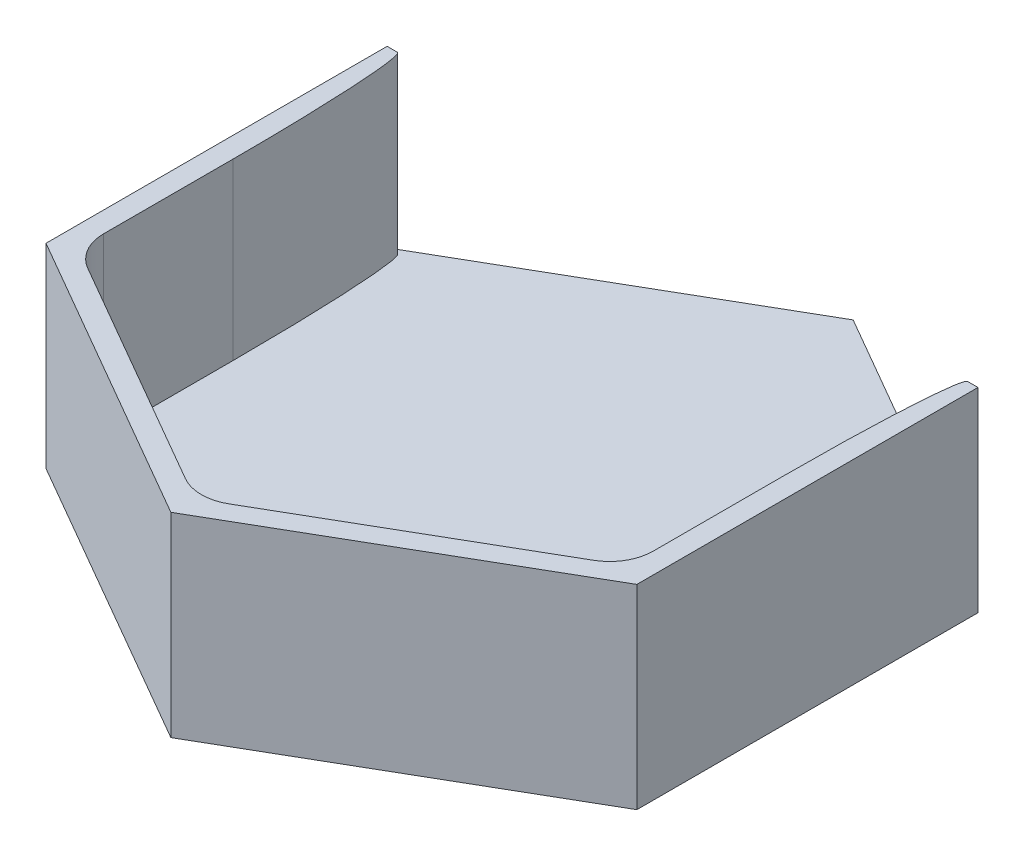
ISO-10303-21;
HEADER;
FILE_DESCRIPTION(('STEP AP214'),'2;1');
FILE_NAME('part.step','',(''),(''),'','','');
FILE_SCHEMA(('AUTOMOTIVE_DESIGN { 1 0 10303 214 1 1 1 1 }'));
ENDSEC;
DATA;
#1=APPLICATION_CONTEXT('core data for automotive mechanical design processes');
#2=APPLICATION_PROTOCOL_DEFINITION('international standard','automotive_design',2000,#1);
#3=PRODUCT_CONTEXT('',#1,'mechanical');
#4=PRODUCT('Part','Part','',(#3));
#5=PRODUCT_RELATED_PRODUCT_CATEGORY('part','',(#4));
#6=PRODUCT_DEFINITION_FORMATION('','',#4);
#7=PRODUCT_DEFINITION_CONTEXT('part definition',#1,'design');
#8=PRODUCT_DEFINITION('design','',#6,#7);
#9=PRODUCT_DEFINITION_SHAPE('','',#8);
#10=(LENGTH_UNIT() NAMED_UNIT(*) SI_UNIT(.MILLI.,.METRE.));
#11=(NAMED_UNIT(*) PLANE_ANGLE_UNIT() SI_UNIT($,.RADIAN.));
#12=(NAMED_UNIT(*) SI_UNIT($,.STERADIAN.) SOLID_ANGLE_UNIT());
#13=UNCERTAINTY_MEASURE_WITH_UNIT(LENGTH_MEASURE(1.E-05),#10,'distance_accuracy_value','');
#14=(GEOMETRIC_REPRESENTATION_CONTEXT(3) GLOBAL_UNCERTAINTY_ASSIGNED_CONTEXT((#13)) GLOBAL_UNIT_ASSIGNED_CONTEXT((#10,
#11,#12)) REPRESENTATION_CONTEXT('',''));
#15=CARTESIAN_POINT('',(0.,0.,0.));
#16=DIRECTION('',(0.,0.,1.));
#17=DIRECTION('',(1.,0.,0.));
#18=AXIS2_PLACEMENT_3D('',#15,#16,#17);
#19=CARTESIAN_POINT('',(-2.48065457064683E-13,25.4,-49.6521231503077));
#20=DIRECTION('',(0.499999999999999,0.,0.866025403784439));
#21=DIRECTION('',(0.866025403784439,0.,-0.499999999999999));
#22=AXIS2_PLACEMENT_3D('',#19,#20,#21);
#23=PLANE('',#22);
#24=DIRECTION('',(0.,-1.,0.));
#25=VECTOR('',#24,1.);
#26=CARTESIAN_POINT('',(-43.,25.4,-24.826061575154));
#27=LINE('',#26,#25);
#28=CARTESIAN_POINT('',(-43.,0.,-24.826061575154));
#29=VERTEX_POINT('',#28);
#30=CARTESIAN_POINT('',(-42.9999999999999,-3.,-24.8260615751542));
#31=VERTEX_POINT('',#30);
#32=EDGE_CURVE('E344',#29,#31,#27,.T.);
#33=ORIENTED_EDGE('',*,*,#32,.F.);
#34=DIRECTION('',(0.866025403784439,0.,-0.499999999999999));
#35=VECTOR('',#34,1.);
#36=CARTESIAN_POINT('',(-41.5,0.,-25.6920869789385));
#37=LINE('',#36,#35);
#38=CARTESIAN_POINT('',(4.02455846426619E-13,0.,-49.6521231503081));
#39=VERTEX_POINT('',#38);
#40=EDGE_CURVE('E227',#29,#39,#37,.T.);
#41=ORIENTED_EDGE('',*,*,#40,.T.);
#42=DIRECTION('',(0.,-1.,0.));
#43=VECTOR('',#42,1.);
#44=CARTESIAN_POINT('',(-2.48065457064683E-13,25.4,-49.6521231503077));
#45=LINE('',#44,#43);
#46=CARTESIAN_POINT('',(4.05925293378573E-13,-3.,-49.6521231503078));
#47=VERTEX_POINT('',#46);
#48=EDGE_CURVE('E224',#39,#47,#45,.T.);
#49=ORIENTED_EDGE('',*,*,#48,.T.);
#50=DIRECTION('',(0.866025403784442,0.,-0.499999999999994));
#51=VECTOR('',#50,1.);
#52=CARTESIAN_POINT('',(-42.9999999999999,-3.,-24.8260615751542));
#53=LINE('',#52,#51);
#54=EDGE_CURVE('E362',#31,#47,#53,.T.);
#55=ORIENTED_EDGE('',*,*,#54,.F.);
#56=EDGE_LOOP('',(#33,#41,#49,#55));
#57=FACE_BOUND('',#56,.T.);
#58=ADVANCED_FACE('F81',(#57),#23,.F.);
#59=CARTESIAN_POINT('',(0.,25.4,0.));
#60=DIRECTION('',(0.,1.,0.));
#61=DIRECTION('',(0.,0.,1.));
#62=AXIS2_PLACEMENT_3D('',#59,#60,#61);
#63=PLANE('',#62);
#64=DIRECTION('',(1.,0.,0.));
#65=VECTOR('',#64,1.);
#66=CARTESIAN_POINT('',(-43.,25.4,-24.826061575154));
#67=LINE('',#66,#65);
#68=CARTESIAN_POINT('',(41.5,25.4,-24.826061575154));
#69=VERTEX_POINT('',#68);
#70=CARTESIAN_POINT('',(43.,25.4,-24.826061575154));
#71=VERTEX_POINT('',#70);
#72=EDGE_CURVE('E233',#69,#71,#67,.T.);
#73=ORIENTED_EDGE('',*,*,#72,.F.);
#74=CARTESIAN_POINT('',(40.,25.4,0.573938424845981));
#75=CARTESIAN_POINT('',(40.0000000000002,25.4,-24.826061575154));
#76=CARTESIAN_POINT('',(41.5,25.4,-24.826061575154));
#77=(BOUNDED_CURVE() B_SPLINE_CURVE(2,(#74,#75,#76),.UNSPECIFIED.,.F.,
.F.) B_SPLINE_CURVE_WITH_KNOTS((3,3),(0.,1.),
.UNSPECIFIED.) CURVE() GEOMETRIC_REPRESENTATION_ITEM() RATIONAL_B_SPLINE_CURVE((1.,
0.707106781186549,1.)) REPRESENTATION_ITEM(''));
#78=CARTESIAN_POINT('',(40.,25.4,0.573938424845981));
#79=VERTEX_POINT('',#78);
#80=EDGE_CURVE('E386',#69,#79,#77,.F.);
#81=ORIENTED_EDGE('',*,*,#80,.T.);
#82=DIRECTION('',(0.,0.,-1.));
#83=VECTOR('',#82,1.);
#84=CARTESIAN_POINT('',(39.9999999999999,25.4,23.0940107675851));
#85=LINE('',#84,#83);
#86=CARTESIAN_POINT('',(39.9999999999999,25.4,19.427836558231));
#87=VERTEX_POINT('',#86);
#88=EDGE_CURVE('E285',#87,#79,#85,.T.);
#89=ORIENTED_EDGE('',*,*,#88,.F.);
#90=CARTESIAN_POINT('',(33.6499999999999,25.4,19.427836558231));
#91=DIRECTION('',(0.,1.,0.));
#92=DIRECTION('',(0.,0.,1.));
#93=AXIS2_PLACEMENT_3D('',#90,#91,#92);
#94=CIRCLE('',#93,6.35);
#95=CARTESIAN_POINT('',(36.825,25.4,24.9270978722622));
#96=VERTEX_POINT('',#95);
#97=EDGE_CURVE('E13',#87,#96,#94,.F.);
#98=ORIENTED_EDGE('',*,*,#97,.T.);
#99=DIRECTION('',(0.866025403784438,0.,-0.500000000000002));
#100=VECTOR('',#99,1.);
#101=CARTESIAN_POINT('',(0.,25.4,46.1880215351702));
#102=LINE('',#101,#100);
#103=CARTESIAN_POINT('',(3.17499999999998,25.4,44.3549344304931));
#104=VERTEX_POINT('',#103);
#105=EDGE_CURVE('E289',#104,#96,#102,.T.);
#106=ORIENTED_EDGE('',*,*,#105,.F.);
#107=CARTESIAN_POINT('',(0.,25.4,38.8556731164619));
#108=DIRECTION('',(0.,1.,0.));
#109=DIRECTION('',(0.,0.,1.));
#110=AXIS2_PLACEMENT_3D('',#107,#108,#109);
#111=CIRCLE('',#110,6.35);
#112=CARTESIAN_POINT('',(-3.17500000000005,25.4,44.3549344304931));
#113=VERTEX_POINT('',#112);
#114=EDGE_CURVE('E90',#104,#113,#111,.F.);
#115=ORIENTED_EDGE('',*,*,#114,.T.);
#116=DIRECTION('',(0.866025403784436,0.,0.500000000000005));
#117=VECTOR('',#116,1.);
#118=CARTESIAN_POINT('',(-40.,25.4,23.0940107675849));
#119=LINE('',#118,#117);
#120=CARTESIAN_POINT('',(-36.8250000000001,25.4,24.927097872262));
#121=VERTEX_POINT('',#120);
#122=EDGE_CURVE('E299',#121,#113,#119,.T.);
#123=ORIENTED_EDGE('',*,*,#122,.F.);
#124=CARTESIAN_POINT('',(-33.65,25.4,19.4278365582308));
#125=DIRECTION('',(0.,1.,0.));
#126=DIRECTION('',(0.,0.,1.));
#127=AXIS2_PLACEMENT_3D('',#124,#125,#126);
#128=CIRCLE('',#127,6.35);
#129=CARTESIAN_POINT('',(-40.,25.4,19.4278365582308));
#130=VERTEX_POINT('',#129);
#131=EDGE_CURVE('E292',#121,#130,#128,.F.);
#132=ORIENTED_EDGE('',*,*,#131,.T.);
#133=DIRECTION('',(0.,0.,1.));
#134=VECTOR('',#133,1.);
#135=CARTESIAN_POINT('',(-40.,25.4,-23.0940107675852));
#136=LINE('',#135,#134);
#137=CARTESIAN_POINT('',(-40.,25.4,0.573938424845988));
#138=VERTEX_POINT('',#137);
#139=EDGE_CURVE('E258',#138,#130,#136,.T.);
#140=ORIENTED_EDGE('',*,*,#139,.F.);
#141=CARTESIAN_POINT('',(-41.5,25.4,-24.826061575154));
#142=CARTESIAN_POINT('',(-40.,25.4,-24.826061575154));
#143=CARTESIAN_POINT('',(-40.,25.4,0.573938424845988));
#144=(BOUNDED_CURVE() B_SPLINE_CURVE(2,(#141,#142,#143),.UNSPECIFIED.,.F.,
.F.) B_SPLINE_CURVE_WITH_KNOTS((3,3),(0.,1.),
.UNSPECIFIED.) CURVE() GEOMETRIC_REPRESENTATION_ITEM() RATIONAL_B_SPLINE_CURVE((1.,
0.707106781186548,1.)) REPRESENTATION_ITEM(''));
#145=CARTESIAN_POINT('',(-41.5,25.4,-24.826061575154));
#146=VERTEX_POINT('',#145);
#147=EDGE_CURVE('E468',#138,#146,#144,.F.);
#148=ORIENTED_EDGE('',*,*,#147,.T.);
#149=CARTESIAN_POINT('',(-43.,25.4,-24.826061575154));
#150=VERTEX_POINT('',#149);
#151=EDGE_CURVE('E215',#150,#146,#67,.T.);
#152=ORIENTED_EDGE('',*,*,#151,.F.);
#153=DIRECTION('',(0.,0.,1.));
#154=VECTOR('',#153,1.);
#155=CARTESIAN_POINT('',(-43.,25.4,-24.826061575154));
#156=LINE('',#155,#154);
#157=CARTESIAN_POINT('',(-43.0000000000001,25.4,24.8260615751537));
#158=VERTEX_POINT('',#157);
#159=EDGE_CURVE('E327',#150,#158,#156,.T.);
#160=ORIENTED_EDGE('',*,*,#159,.T.);
#161=DIRECTION('',(0.866025403784438,0.,0.500000000000001));
#162=VECTOR('',#161,1.);
#163=CARTESIAN_POINT('',(-43.0000000000001,25.4,24.8260615751537));
#164=LINE('',#163,#162);
#165=CARTESIAN_POINT('',(0.,25.4,49.6521231503078));
#166=VERTEX_POINT('',#165);
#167=EDGE_CURVE('E330',#158,#166,#164,.T.);
#168=ORIENTED_EDGE('',*,*,#167,.T.);
#169=DIRECTION('',(0.866025403784438,0.,-0.500000000000001));
#170=VECTOR('',#169,1.);
#171=CARTESIAN_POINT('',(0.,25.4,49.6521231503078));
#172=LINE('',#171,#170);
#173=CARTESIAN_POINT('',(43.0000000000001,25.4,24.8260615751539));
#174=VERTEX_POINT('',#173);
#175=EDGE_CURVE('E333',#166,#174,#172,.T.);
#176=ORIENTED_EDGE('',*,*,#175,.T.);
#177=DIRECTION('',(0.,0.,-1.));
#178=VECTOR('',#177,1.);
#179=CARTESIAN_POINT('',(43.0000000000001,25.4,24.8260615751539));
#180=LINE('',#179,#178);
#181=EDGE_CURVE('E288',#174,#71,#180,.T.);
#182=ORIENTED_EDGE('',*,*,#181,.T.);
#183=EDGE_LOOP('',(#73,#81,#89,#98,#106,#115,#123,#132,#140,#148,#152,#160,#168,#176,#182));
#184=FACE_BOUND('',#183,.T.);
#185=ADVANCED_FACE('F298',(#184),#63,.T.);
#186=CARTESIAN_POINT('',(43.0000000000001,25.4,24.8260615751539));
#187=DIRECTION('',(-1.,0.,0.));
#188=DIRECTION('',(0.,0.,1.));
#189=AXIS2_PLACEMENT_3D('',#186,#187,#188);
#190=PLANE('',#189);
#191=DIRECTION('',(0.,-1.,0.));
#192=VECTOR('',#191,1.);
#193=CARTESIAN_POINT('',(43.0000000000001,25.4,24.8260615751539));
#194=LINE('',#193,#192);
#195=CARTESIAN_POINT('',(43.0000000000001,-3.,24.8260615751539));
#196=VERTEX_POINT('',#195);
#197=EDGE_CURVE('E336',#174,#196,#194,.T.);
#198=ORIENTED_EDGE('',*,*,#197,.T.);
#199=DIRECTION('',(0.,0.,1.));
#200=VECTOR('',#199,1.);
#201=CARTESIAN_POINT('',(43.0000000000003,-3.,-24.8260615751535));
#202=LINE('',#201,#200);
#203=CARTESIAN_POINT('',(43.0000000000003,-3.,-24.8260615751535));
#204=VERTEX_POINT('',#203);
#205=EDGE_CURVE('E226',#204,#196,#202,.T.);
#206=ORIENTED_EDGE('',*,*,#205,.F.);
#207=DIRECTION('',(0.,-1.,0.));
#208=VECTOR('',#207,1.);
#209=CARTESIAN_POINT('',(43.,25.4,-24.8260615751537));
#210=LINE('',#209,#208);
#211=CARTESIAN_POINT('',(43.,0.,-24.826061575154));
#212=VERTEX_POINT('',#211);
#213=EDGE_CURVE('E222',#212,#204,#210,.T.);
#214=ORIENTED_EDGE('',*,*,#213,.F.);
#215=EDGE_CURVE('E230',#71,#212,#210,.T.);
#216=ORIENTED_EDGE('',*,*,#215,.F.);
#217=ORIENTED_EDGE('',*,*,#181,.F.);
#218=EDGE_LOOP('',(#198,#206,#214,#216,#217));
#219=FACE_BOUND('',#218,.T.);
#220=ADVANCED_FACE('F241',(#219),#190,.F.);
#221=CARTESIAN_POINT('',(43.,25.4,-24.8260615751537));
#222=DIRECTION('',(-0.5,0.,0.866025403784439));
#223=DIRECTION('',(0.866025403784439,0.,0.5));
#224=AXIS2_PLACEMENT_3D('',#221,#222,#223);
#225=PLANE('',#224);
#226=DIRECTION('',(0.866025403784439,0.,0.5));
#227=VECTOR('',#226,1.);
#228=CARTESIAN_POINT('',(-18.5000000000002,0.,-60.3331031303158));
#229=LINE('',#228,#227);
#230=EDGE_CURVE('E204',#39,#212,#229,.T.);
#231=ORIENTED_EDGE('',*,*,#230,.T.);
#232=ORIENTED_EDGE('',*,*,#213,.T.);
#233=DIRECTION('',(0.866025403784434,0.,0.500000000000008));
#234=VECTOR('',#233,1.);
#235=CARTESIAN_POINT('',(4.05925293378573E-13,-3.,-49.6521231503078));
#236=LINE('',#235,#234);
#237=EDGE_CURVE('E369',#47,#204,#236,.T.);
#238=ORIENTED_EDGE('',*,*,#237,.F.);
#239=ORIENTED_EDGE('',*,*,#48,.F.);
#240=EDGE_LOOP('',(#231,#232,#238,#239));
#241=FACE_BOUND('',#240,.T.);
#242=ADVANCED_FACE('F219',(#241),#225,.F.);
#243=CARTESIAN_POINT('',(-43.,25.4,-24.826061575154));
#244=DIRECTION('',(1.,0.,0.));
#245=DIRECTION('',(0.,0.,-1.));
#246=AXIS2_PLACEMENT_3D('',#243,#244,#245);
#247=PLANE('',#246);
#248=EDGE_CURVE('E245',#150,#29,#27,.T.);
#249=ORIENTED_EDGE('',*,*,#248,.T.);
#250=ORIENTED_EDGE('',*,*,#32,.T.);
#251=DIRECTION('',(0.,0.,-1.));
#252=VECTOR('',#251,1.);
#253=CARTESIAN_POINT('',(-43.0000000000001,-3.,24.8260615751538));
#254=LINE('',#253,#252);
#255=CARTESIAN_POINT('',(-43.0000000000001,-3.,24.8260615751538));
#256=VERTEX_POINT('',#255);
#257=EDGE_CURVE('E355',#256,#31,#254,.T.);
#258=ORIENTED_EDGE('',*,*,#257,.F.);
#259=DIRECTION('',(0.,-1.,0.));
#260=VECTOR('',#259,1.);
#261=CARTESIAN_POINT('',(-43.0000000000001,25.4,24.8260615751537));
#262=LINE('',#261,#260);
#263=EDGE_CURVE('E342',#158,#256,#262,.T.);
#264=ORIENTED_EDGE('',*,*,#263,.F.);
#265=ORIENTED_EDGE('',*,*,#159,.F.);
#266=EDGE_LOOP('',(#249,#250,#258,#264,#265));
#267=FACE_BOUND('',#266,.T.);
#268=ADVANCED_FACE('F353',(#267),#247,.F.);
#269=CARTESIAN_POINT('',(-43.0000000000001,25.4,24.8260615751537));
#270=DIRECTION('',(0.500000000000001,0.,-0.866025403784438));
#271=DIRECTION('',(-0.866025403784438,0.,-0.500000000000001));
#272=AXIS2_PLACEMENT_3D('',#269,#270,#271);
#273=PLANE('',#272);
#274=ORIENTED_EDGE('',*,*,#263,.T.);
#275=DIRECTION('',(-0.866025403784437,0.,-0.500000000000002));
#276=VECTOR('',#275,1.);
#277=CARTESIAN_POINT('',(0.,-3.,49.6521231503079));
#278=LINE('',#277,#276);
#279=CARTESIAN_POINT('',(0.,-3.,49.6521231503079));
#280=VERTEX_POINT('',#279);
#281=EDGE_CURVE('E365',#280,#256,#278,.T.);
#282=ORIENTED_EDGE('',*,*,#281,.F.);
#283=DIRECTION('',(0.,-1.,0.));
#284=VECTOR('',#283,1.);
#285=CARTESIAN_POINT('',(0.,25.4,49.6521231503078));
#286=LINE('',#285,#284);
#287=EDGE_CURVE('E339',#166,#280,#286,.T.);
#288=ORIENTED_EDGE('',*,*,#287,.F.);
#289=ORIENTED_EDGE('',*,*,#167,.F.);
#290=EDGE_LOOP('',(#274,#282,#288,#289));
#291=FACE_BOUND('',#290,.T.);
#292=ADVANCED_FACE('F572',(#291),#273,.F.);
#293=CARTESIAN_POINT('',(0.,25.4,49.6521231503078));
#294=DIRECTION('',(-0.500000000000001,0.,-0.866025403784438));
#295=DIRECTION('',(-0.866025403784438,0.,0.500000000000001));
#296=AXIS2_PLACEMENT_3D('',#293,#294,#295);
#297=PLANE('',#296);
#298=ORIENTED_EDGE('',*,*,#287,.T.);
#299=DIRECTION('',(-0.866025403784439,0.,0.5));
#300=VECTOR('',#299,1.);
#301=CARTESIAN_POINT('',(43.0000000000001,-3.,24.8260615751539));
#302=LINE('',#301,#300);
#303=EDGE_CURVE('E824',#196,#280,#302,.T.);
#304=ORIENTED_EDGE('',*,*,#303,.F.);
#305=ORIENTED_EDGE('',*,*,#197,.F.);
#306=ORIENTED_EDGE('',*,*,#175,.F.);
#307=EDGE_LOOP('',(#298,#304,#305,#306));
#308=FACE_BOUND('',#307,.T.);
#309=ADVANCED_FACE('F561',(#308),#297,.F.);
#310=CARTESIAN_POINT('',(-40.,25.4,-23.0940107675852));
#311=DIRECTION('',(1.,0.,0.));
#312=DIRECTION('',(0.,0.,-1.));
#313=AXIS2_PLACEMENT_3D('',#310,#311,#312);
#314=PLANE('',#313);
#315=ORIENTED_EDGE('',*,*,#139,.T.);
#316=DIRECTION('',(0.,-1.,0.));
#317=VECTOR('',#316,1.);
#318=CARTESIAN_POINT('',(-40.,0.,19.4278365582308));
#319=LINE('',#318,#317);
#320=CARTESIAN_POINT('',(-40.,0.,19.4278365582308));
#321=VERTEX_POINT('',#320);
#322=EDGE_CURVE('E260',#130,#321,#319,.T.);
#323=ORIENTED_EDGE('',*,*,#322,.T.);
#324=DIRECTION('',(0.,0.,1.));
#325=VECTOR('',#324,1.);
#326=CARTESIAN_POINT('',(-40.,0.,-23.0940107675852));
#327=LINE('',#326,#325);
#328=CARTESIAN_POINT('',(-40.,0.,0.573938424845988));
#329=VERTEX_POINT('',#328);
#330=EDGE_CURVE('E321',#329,#321,#327,.T.);
#331=ORIENTED_EDGE('',*,*,#330,.F.);
#332=CARTESIAN_POINT('',(-40.,26.67,0.573938424845988));
#333=CARTESIAN_POINT('',(-40.,17.3566666666667,0.573938424845988));
#334=CARTESIAN_POINT('',(-40.,8.04333333333332,0.573938424845988));
#335=CARTESIAN_POINT('',(-40.,-1.26999999999999,0.573938424845988));
#336=(BOUNDED_CURVE() B_SPLINE_CURVE(3,(#332,#333,#334,#335),.UNSPECIFIED.,.F.,
.F.) B_SPLINE_CURVE_WITH_KNOTS((4,4),(0.0847474400921116,0.112687440092112),
.UNSPECIFIED.) CURVE() GEOMETRIC_REPRESENTATION_ITEM() RATIONAL_B_SPLINE_CURVE((1.,1.,1.,1.)) REPRESENTATION_ITEM(''));
#337=EDGE_CURVE('E394',#329,#138,#336,.F.);
#338=ORIENTED_EDGE('',*,*,#337,.T.);
#339=EDGE_LOOP('',(#315,#323,#331,#338));
#340=FACE_BOUND('',#339,.T.);
#341=ADVANCED_FACE('F558',(#340),#314,.T.);
#342=CARTESIAN_POINT('',(-40.,25.4,23.0940107675849));
#343=DIRECTION('',(0.500000000000005,0.,-0.866025403784436));
#344=DIRECTION('',(-0.866025403784436,0.,-0.500000000000005));
#345=AXIS2_PLACEMENT_3D('',#342,#343,#344);
#346=PLANE('',#345);
#347=DIRECTION('',(0.866025403784436,0.,0.500000000000005));
#348=VECTOR('',#347,1.);
#349=CARTESIAN_POINT('',(-40.,0.,23.0940107675849));
#350=LINE('',#349,#348);
#351=CARTESIAN_POINT('',(-36.8250000000001,0.,24.927097872262));
#352=VERTEX_POINT('',#351);
#353=CARTESIAN_POINT('',(-3.17500000000005,0.,44.3549344304931));
#354=VERTEX_POINT('',#353);
#355=EDGE_CURVE('E314',#352,#354,#350,.T.);
#356=ORIENTED_EDGE('',*,*,#355,.F.);
#357=DIRECTION('',(0.,-1.,0.));
#358=VECTOR('',#357,1.);
#359=CARTESIAN_POINT('',(-36.8250000000001,25.4,24.927097872262));
#360=LINE('',#359,#358);
#361=EDGE_CURVE('E275',#352,#121,#360,.F.);
#362=ORIENTED_EDGE('',*,*,#361,.T.);
#363=ORIENTED_EDGE('',*,*,#122,.T.);
#364=DIRECTION('',(0.,-1.,0.));
#365=VECTOR('',#364,1.);
#366=CARTESIAN_POINT('',(-3.17500000000006,0.,44.3549344304931));
#367=LINE('',#366,#365);
#368=EDGE_CURVE('E271',#113,#354,#367,.T.);
#369=ORIENTED_EDGE('',*,*,#368,.T.);
#370=EDGE_LOOP('',(#356,#362,#363,#369));
#371=FACE_BOUND('',#370,.T.);
#372=ADVANCED_FACE('F306',(#371),#346,.T.);
#373=CARTESIAN_POINT('',(0.,25.4,46.1880215351702));
#374=DIRECTION('',(-0.500000000000001,0.,-0.866025403784438));
#375=DIRECTION('',(-0.866025403784438,0.,0.500000000000002));
#376=AXIS2_PLACEMENT_3D('',#373,#374,#375);
#377=PLANE('',#376);
#378=DIRECTION('',(0.866025403784438,0.,-0.500000000000002));
#379=VECTOR('',#378,1.);
#380=CARTESIAN_POINT('',(0.,0.,46.1880215351702));
#381=LINE('',#380,#379);
#382=CARTESIAN_POINT('',(3.17499999999998,0.,44.3549344304931));
#383=VERTEX_POINT('',#382);
#384=CARTESIAN_POINT('',(36.825,0.,24.9270978722622));
#385=VERTEX_POINT('',#384);
#386=EDGE_CURVE('E259',#383,#385,#381,.T.);
#387=ORIENTED_EDGE('',*,*,#386,.F.);
#388=DIRECTION('',(0.,-1.,0.));
#389=VECTOR('',#388,1.);
#390=CARTESIAN_POINT('',(3.17499999999998,25.4,44.3549344304931));
#391=LINE('',#390,#389);
#392=EDGE_CURVE('E282',#383,#104,#391,.F.);
#393=ORIENTED_EDGE('',*,*,#392,.T.);
#394=ORIENTED_EDGE('',*,*,#105,.T.);
#395=DIRECTION('',(0.,-1.,0.));
#396=VECTOR('',#395,1.);
#397=CARTESIAN_POINT('',(36.825,0.,24.9270978722622));
#398=LINE('',#397,#396);
#399=EDGE_CURVE('E278',#96,#385,#398,.T.);
#400=ORIENTED_EDGE('',*,*,#399,.T.);
#401=EDGE_LOOP('',(#387,#393,#394,#400));
#402=FACE_BOUND('',#401,.T.);
#403=ADVANCED_FACE('F316',(#402),#377,.T.);
#404=CARTESIAN_POINT('',(39.9999999999999,25.4,23.0940107675851));
#405=DIRECTION('',(-1.,0.,0.));
#406=DIRECTION('',(0.,0.,1.));
#407=AXIS2_PLACEMENT_3D('',#404,#405,#406);
#408=PLANE('',#407);
#409=DIRECTION('',(0.,0.,-1.));
#410=VECTOR('',#409,1.);
#411=CARTESIAN_POINT('',(39.9999999999999,0.,23.0940107675851));
#412=LINE('',#411,#410);
#413=CARTESIAN_POINT('',(39.9999999999999,0.,19.427836558231));
#414=VERTEX_POINT('',#413);
#415=CARTESIAN_POINT('',(40.,0.,0.573938424845981));
#416=VERTEX_POINT('',#415);
#417=EDGE_CURVE('E254',#414,#416,#412,.T.);
#418=ORIENTED_EDGE('',*,*,#417,.F.);
#419=DIRECTION('',(0.,-1.,0.));
#420=VECTOR('',#419,1.);
#421=CARTESIAN_POINT('',(39.9999999999999,25.4,19.427836558231));
#422=LINE('',#421,#420);
#423=EDGE_CURVE('E97',#414,#87,#422,.F.);
#424=ORIENTED_EDGE('',*,*,#423,.T.);
#425=ORIENTED_EDGE('',*,*,#88,.T.);
#426=CARTESIAN_POINT('',(40.,-1.26999999999997,0.573938424845981));
#427=CARTESIAN_POINT('',(40.,8.04333333333336,0.573938424845981));
#428=CARTESIAN_POINT('',(40.,17.3566666666667,0.573938424845981));
#429=CARTESIAN_POINT('',(40.,26.67,0.573938424845981));
#430=(BOUNDED_CURVE() B_SPLINE_CURVE(3,(#426,#427,#428,#429),.UNSPECIFIED.,.F.,
.F.) B_SPLINE_CURVE_WITH_KNOTS((4,4),(-0.112687440092112,-0.0847474400921116),
.UNSPECIFIED.) CURVE() GEOMETRIC_REPRESENTATION_ITEM() RATIONAL_B_SPLINE_CURVE((1.,1.,1.,1.)) REPRESENTATION_ITEM(''));
#431=EDGE_CURVE('E379',#79,#416,#430,.F.);
#432=ORIENTED_EDGE('',*,*,#431,.T.);
#433=EDGE_LOOP('',(#418,#424,#425,#432));
#434=FACE_BOUND('',#433,.T.);
#435=ADVANCED_FACE('F377',(#434),#408,.T.);
#436=CARTESIAN_POINT('',(0.,0.,0.));
#437=DIRECTION('',(0.,-1.,0.));
#438=DIRECTION('',(0.,0.,-1.));
#439=AXIS2_PLACEMENT_3D('',#436,#437,#438);
#440=PLANE('',#439);
#441=ORIENTED_EDGE('',*,*,#330,.T.);
#442=CARTESIAN_POINT('',(-33.65,0.,19.4278365582308));
#443=DIRECTION('',(0.,-1.,0.));
#444=DIRECTION('',(0.,0.,-1.));
#445=AXIS2_PLACEMENT_3D('',#442,#443,#444);
#446=CIRCLE('',#445,6.35);
#447=EDGE_CURVE('E268',#321,#352,#446,.F.);
#448=ORIENTED_EDGE('',*,*,#447,.T.);
#449=ORIENTED_EDGE('',*,*,#355,.T.);
#450=CARTESIAN_POINT('',(0.,0.,38.8556731164619));
#451=DIRECTION('',(0.,-1.,0.));
#452=DIRECTION('',(0.,0.,-1.));
#453=AXIS2_PLACEMENT_3D('',#450,#451,#452);
#454=CIRCLE('',#453,6.35);
#455=EDGE_CURVE('E265',#354,#383,#454,.F.);
#456=ORIENTED_EDGE('',*,*,#455,.T.);
#457=ORIENTED_EDGE('',*,*,#386,.T.);
#458=CARTESIAN_POINT('',(33.6499999999999,0.,19.427836558231));
#459=DIRECTION('',(0.,-1.,0.));
#460=DIRECTION('',(0.,0.,-1.));
#461=AXIS2_PLACEMENT_3D('',#458,#459,#460);
#462=CIRCLE('',#461,6.35);
#463=EDGE_CURVE('E262',#385,#414,#462,.F.);
#464=ORIENTED_EDGE('',*,*,#463,.T.);
#465=ORIENTED_EDGE('',*,*,#417,.T.);
#466=CARTESIAN_POINT('',(41.5,0.,-24.826061575154));
#467=CARTESIAN_POINT('',(40.0000000000002,0.,-24.826061575154));
#468=CARTESIAN_POINT('',(40.,0.,0.573938424845981));
#469=(BOUNDED_CURVE() B_SPLINE_CURVE(2,(#466,#467,#468),.UNSPECIFIED.,.F.,
.F.) B_SPLINE_CURVE_WITH_KNOTS((3,3),(0.,1.),
.UNSPECIFIED.) CURVE() GEOMETRIC_REPRESENTATION_ITEM() RATIONAL_B_SPLINE_CURVE((1.,
0.707106781186549,1.)) REPRESENTATION_ITEM(''));
#470=CARTESIAN_POINT('',(41.5,0.,-24.826061575154));
#471=VERTEX_POINT('',#470);
#472=EDGE_CURVE('E207',#416,#471,#469,.F.);
#473=ORIENTED_EDGE('',*,*,#472,.T.);
#474=DIRECTION('',(1.,0.,0.));
#475=VECTOR('',#474,1.);
#476=CARTESIAN_POINT('',(-43.,0.,-24.826061575154));
#477=LINE('',#476,#475);
#478=EDGE_CURVE('E200',#471,#212,#477,.T.);
#479=ORIENTED_EDGE('',*,*,#478,.T.);
#480=ORIENTED_EDGE('',*,*,#230,.F.);
#481=ORIENTED_EDGE('',*,*,#40,.F.);
#482=CARTESIAN_POINT('',(-41.5,0.,-24.826061575154));
#483=VERTEX_POINT('',#482);
#484=EDGE_CURVE('E214',#29,#483,#477,.T.);
#485=ORIENTED_EDGE('',*,*,#484,.T.);
#486=CARTESIAN_POINT('',(-40.,0.,0.573938424845988));
#487=CARTESIAN_POINT('',(-40.,0.,-24.826061575154));
#488=CARTESIAN_POINT('',(-41.5,0.,-24.826061575154));
#489=(BOUNDED_CURVE() B_SPLINE_CURVE(2,(#486,#487,#488),.UNSPECIFIED.,.F.,
.F.) B_SPLINE_CURVE_WITH_KNOTS((3,3),(0.,1.),
.UNSPECIFIED.) CURVE() GEOMETRIC_REPRESENTATION_ITEM() RATIONAL_B_SPLINE_CURVE((1.,
0.707106781186548,1.)) REPRESENTATION_ITEM(''));
#490=EDGE_CURVE('E393',#483,#329,#489,.F.);
#491=ORIENTED_EDGE('',*,*,#490,.T.);
#492=EDGE_LOOP('',(#441,#448,#449,#456,#457,#464,#465,#473,#479,#480,#481,#485,#491));
#493=FACE_BOUND('',#492,.T.);
#494=ADVANCED_FACE('F203',(#493),#440,.F.);
#495=CARTESIAN_POINT('',(0.,-3.,0.));
#496=DIRECTION('',(0.,-1.,0.));
#497=DIRECTION('',(0.,0.,-1.));
#498=AXIS2_PLACEMENT_3D('',#495,#496,#497);
#499=PLANE('',#498);
#500=ORIENTED_EDGE('',*,*,#205,.T.);
#501=ORIENTED_EDGE('',*,*,#303,.T.);
#502=ORIENTED_EDGE('',*,*,#281,.T.);
#503=ORIENTED_EDGE('',*,*,#257,.T.);
#504=ORIENTED_EDGE('',*,*,#54,.T.);
#505=ORIENTED_EDGE('',*,*,#237,.T.);
#506=EDGE_LOOP('',(#500,#501,#502,#503,#504,#505));
#507=FACE_BOUND('',#506,.T.);
#508=ADVANCED_FACE('F361',(#507),#499,.T.);
#509=CARTESIAN_POINT('',(-43.,-86.0174400921116,-24.826061575154));
#510=DIRECTION('',(0.,0.,1.));
#511=DIRECTION('',(1.,0.,0.));
#512=AXIS2_PLACEMENT_3D('',#509,#510,#511);
#513=PLANE('',#512);
#514=ORIENTED_EDGE('',*,*,#478,.F.);
#515=CARTESIAN_POINT('',(41.5,26.67,-24.826061575154));
#516=CARTESIAN_POINT('',(41.5,17.3566666666667,-24.826061575154));
#517=CARTESIAN_POINT('',(41.5,8.04333333333336,-24.826061575154));
#518=CARTESIAN_POINT('',(41.5,-1.26999999999997,-24.826061575154));
#519=(BOUNDED_CURVE() B_SPLINE_CURVE(3,(#515,#516,#517,#518),.UNSPECIFIED.,.F.,
.F.) B_SPLINE_CURVE_WITH_KNOTS((4,4),(-0.112687440092112,-0.0847474400921116),
.UNSPECIFIED.) CURVE() GEOMETRIC_REPRESENTATION_ITEM() RATIONAL_B_SPLINE_CURVE((1.,1.,1.,1.)) REPRESENTATION_ITEM(''));
#520=EDGE_CURVE('E238',#471,#69,#519,.F.);
#521=ORIENTED_EDGE('',*,*,#520,.T.);
#522=ORIENTED_EDGE('',*,*,#72,.T.);
#523=ORIENTED_EDGE('',*,*,#215,.T.);
#524=EDGE_LOOP('',(#514,#521,#522,#523));
#525=FACE_BOUND('',#524,.T.);
#526=ADVANCED_FACE('F231',(#525),#513,.F.);
#527=ORIENTED_EDGE('',*,*,#151,.T.);
#528=CARTESIAN_POINT('',(-41.5,-1.26999999999999,-24.826061575154));
#529=CARTESIAN_POINT('',(-41.5,8.04333333333332,-24.826061575154));
#530=CARTESIAN_POINT('',(-41.5,17.3566666666667,-24.826061575154));
#531=CARTESIAN_POINT('',(-41.5,26.67,-24.826061575154));
#532=(BOUNDED_CURVE() B_SPLINE_CURVE(3,(#528,#529,#530,#531),.UNSPECIFIED.,.F.,
.F.) B_SPLINE_CURVE_WITH_KNOTS((4,4),(0.0847474400921116,0.112687440092112),
.UNSPECIFIED.) CURVE() GEOMETRIC_REPRESENTATION_ITEM() RATIONAL_B_SPLINE_CURVE((1.,1.,1.,1.)) REPRESENTATION_ITEM(''));
#533=EDGE_CURVE('E385',#146,#483,#532,.F.);
#534=ORIENTED_EDGE('',*,*,#533,.T.);
#535=ORIENTED_EDGE('',*,*,#484,.F.);
#536=ORIENTED_EDGE('',*,*,#248,.F.);
#537=EDGE_LOOP('',(#527,#534,#535,#536));
#538=FACE_BOUND('',#537,.T.);
#539=ADVANCED_FACE('F418',(#538),#513,.F.);
#540=CARTESIAN_POINT('',(40.,26.67,0.573938424845981));
#541=CARTESIAN_POINT('',(40.,17.3566666666667,0.573938424845981));
#542=CARTESIAN_POINT('',(40.,8.04333333333336,0.573938424845981));
#543=CARTESIAN_POINT('',(40.,-1.26999999999997,0.573938424845981));
#544=CARTESIAN_POINT('',(40.0000000000002,26.67,-24.826061575154));
#545=CARTESIAN_POINT('',(40.0000000000002,17.3566666666667,-24.826061575154));
#546=CARTESIAN_POINT('',(40.0000000000002,8.04333333333336,-24.826061575154));
#547=CARTESIAN_POINT('',(40.0000000000002,-1.26999999999997,-24.826061575154));
#548=CARTESIAN_POINT('',(41.5,26.67,-24.826061575154));
#549=CARTESIAN_POINT('',(41.5,17.3566666666667,-24.826061575154));
#550=CARTESIAN_POINT('',(41.5,8.04333333333336,-24.826061575154));
#551=CARTESIAN_POINT('',(41.5,-1.26999999999997,-24.826061575154));
#552=(BOUNDED_SURFACE() B_SPLINE_SURFACE(2,3,((#540,#541,#542,#543),(#544,#545,#546,#547),(#548,
#549,#550,#551)),.UNSPECIFIED.,.F.,.F.,.F.) B_SPLINE_SURFACE_WITH_KNOTS((3,3),(4,4),(0.,1.),
(-0.112687440092112,-0.0847474400921116),
.UNSPECIFIED.) GEOMETRIC_REPRESENTATION_ITEM() RATIONAL_B_SPLINE_SURFACE(((1.,1.,1.,1.),
(0.707106781186549,0.707106781186549,0.707106781186549,0.707106781186549),(1.,1.,1.,1.))) REPRESENTATION_ITEM('') SURFACE());
#553=ORIENTED_EDGE('',*,*,#472,.F.);
#554=ORIENTED_EDGE('',*,*,#431,.F.);
#555=ORIENTED_EDGE('',*,*,#80,.F.);
#556=ORIENTED_EDGE('',*,*,#520,.F.);
#557=EDGE_LOOP('',(#553,#554,#555,#556));
#558=FACE_BOUND('',#557,.T.);
#559=ADVANCED_FACE('F390',(#558),#552,.T.);
#560=CARTESIAN_POINT('',(-40.,-1.26999999999999,0.573938424845988));
#561=CARTESIAN_POINT('',(-40.,8.04333333333332,0.573938424845988));
#562=CARTESIAN_POINT('',(-40.,17.3566666666667,0.573938424845988));
#563=CARTESIAN_POINT('',(-40.,26.67,0.573938424845988));
#564=CARTESIAN_POINT('',(-40.,-1.26999999999999,-24.826061575154));
#565=CARTESIAN_POINT('',(-40.,8.04333333333332,-24.826061575154));
#566=CARTESIAN_POINT('',(-40.,17.3566666666667,-24.826061575154));
#567=CARTESIAN_POINT('',(-40.,26.67,-24.826061575154));
#568=CARTESIAN_POINT('',(-41.5,-1.26999999999999,-24.826061575154));
#569=CARTESIAN_POINT('',(-41.5,8.04333333333332,-24.826061575154));
#570=CARTESIAN_POINT('',(-41.5,17.3566666666667,-24.826061575154));
#571=CARTESIAN_POINT('',(-41.5,26.67,-24.826061575154));
#572=(BOUNDED_SURFACE() B_SPLINE_SURFACE(2,3,((#560,#561,#562,#563),(#564,#565,#566,#567),(#568,
#569,#570,#571)),.UNSPECIFIED.,.F.,.F.,.F.) B_SPLINE_SURFACE_WITH_KNOTS((3,3),(4,4),(0.,1.),
(0.0847474400921116,0.112687440092112),
.UNSPECIFIED.) GEOMETRIC_REPRESENTATION_ITEM() RATIONAL_B_SPLINE_SURFACE(((1.,1.,1.,1.),
(0.707106781186548,0.707106781186548,0.707106781186548,0.707106781186548),(1.,1.,1.,1.))) REPRESENTATION_ITEM('') SURFACE());
#573=ORIENTED_EDGE('',*,*,#147,.F.);
#574=ORIENTED_EDGE('',*,*,#337,.F.);
#575=ORIENTED_EDGE('',*,*,#490,.F.);
#576=ORIENTED_EDGE('',*,*,#533,.F.);
#577=EDGE_LOOP('',(#573,#574,#575,#576));
#578=FACE_BOUND('',#577,.T.);
#579=ADVANCED_FACE('F417',(#578),#572,.T.);
#580=CARTESIAN_POINT('',(-33.65,25.4,19.4278365582308));
#581=DIRECTION('',(0.,1.,0.));
#582=DIRECTION('',(0.,0.,1.));
#583=AXIS2_PLACEMENT_3D('',#580,#581,#582);
#584=CYLINDRICAL_SURFACE('',#583,6.35);
#585=ORIENTED_EDGE('',*,*,#131,.F.);
#586=ORIENTED_EDGE('',*,*,#361,.F.);
#587=ORIENTED_EDGE('',*,*,#447,.F.);
#588=ORIENTED_EDGE('',*,*,#322,.F.);
#589=EDGE_LOOP('',(#585,#586,#587,#588));
#590=FACE_BOUND('',#589,.T.);
#591=ADVANCED_FACE('F665',(#590),#584,.F.);
#592=CARTESIAN_POINT('',(0.,25.4,38.8556731164619));
#593=DIRECTION('',(0.,1.,0.));
#594=DIRECTION('',(0.,0.,1.));
#595=AXIS2_PLACEMENT_3D('',#592,#593,#594);
#596=CYLINDRICAL_SURFACE('',#595,6.35);
#597=ORIENTED_EDGE('',*,*,#114,.F.);
#598=ORIENTED_EDGE('',*,*,#392,.F.);
#599=ORIENTED_EDGE('',*,*,#455,.F.);
#600=ORIENTED_EDGE('',*,*,#368,.F.);
#601=EDGE_LOOP('',(#597,#598,#599,#600));
#602=FACE_BOUND('',#601,.T.);
#603=ADVANCED_FACE('F311',(#602),#596,.F.);
#604=CARTESIAN_POINT('',(33.6499999999999,25.4,19.427836558231));
#605=DIRECTION('',(0.,1.,0.));
#606=DIRECTION('',(0.,0.,1.));
#607=AXIS2_PLACEMENT_3D('',#604,#605,#606);
#608=CYLINDRICAL_SURFACE('',#607,6.35);
#609=ORIENTED_EDGE('',*,*,#97,.F.);
#610=ORIENTED_EDGE('',*,*,#423,.F.);
#611=ORIENTED_EDGE('',*,*,#463,.F.);
#612=ORIENTED_EDGE('',*,*,#399,.F.);
#613=EDGE_LOOP('',(#609,#610,#611,#612));
#614=FACE_BOUND('',#613,.T.);
#615=ADVANCED_FACE('F83',(#614),#608,.F.);
#616=CLOSED_SHELL('',(#58,#185,#220,#242,#268,#292,#309,#341,#372,#403,#435,#494,#508,#526,#539,
#559,#579,#591,#603,#615));
#617=MANIFOLD_SOLID_BREP('B2',#616);
#618=ADVANCED_BREP_SHAPE_REPRESENTATION('',(#18,#617),#14);
#619=SHAPE_DEFINITION_REPRESENTATION(#9,#618);
ENDSEC;
END-ISO-10303-21;
